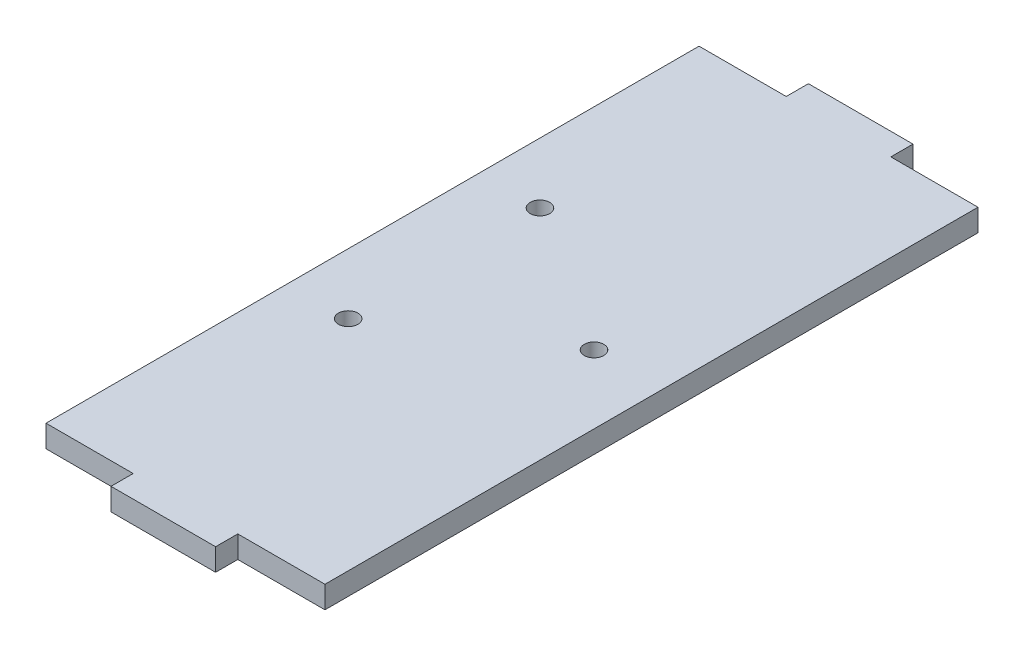
ISO-10303-21;
HEADER;
FILE_DESCRIPTION(('STEP AP214'),'2;1');
FILE_NAME('part.step','',(''),(''),'','','');
FILE_SCHEMA(('AUTOMOTIVE_DESIGN { 1 0 10303 214 1 1 1 1 }'));
ENDSEC;
DATA;
#1=APPLICATION_CONTEXT('core data for automotive mechanical design processes');
#2=APPLICATION_PROTOCOL_DEFINITION('international standard','automotive_design',2000,#1);
#3=PRODUCT_CONTEXT('',#1,'mechanical');
#4=PRODUCT('Part','Part','',(#3));
#5=PRODUCT_RELATED_PRODUCT_CATEGORY('part','',(#4));
#6=PRODUCT_DEFINITION_FORMATION('','',#4);
#7=PRODUCT_DEFINITION_CONTEXT('part definition',#1,'design');
#8=PRODUCT_DEFINITION('design','',#6,#7);
#9=PRODUCT_DEFINITION_SHAPE('','',#8);
#10=(LENGTH_UNIT() NAMED_UNIT(*) SI_UNIT(.MILLI.,.METRE.));
#11=(NAMED_UNIT(*) PLANE_ANGLE_UNIT() SI_UNIT($,.RADIAN.));
#12=(NAMED_UNIT(*) SI_UNIT($,.STERADIAN.) SOLID_ANGLE_UNIT());
#13=UNCERTAINTY_MEASURE_WITH_UNIT(LENGTH_MEASURE(1.E-05),#10,'distance_accuracy_value','');
#14=(GEOMETRIC_REPRESENTATION_CONTEXT(3) GLOBAL_UNCERTAINTY_ASSIGNED_CONTEXT((#13)) GLOBAL_UNIT_ASSIGNED_CONTEXT((#10,
#11,#12)) REPRESENTATION_CONTEXT('',''));
#15=CARTESIAN_POINT('',(0.,0.,0.));
#16=DIRECTION('',(0.,0.,1.));
#17=DIRECTION('',(1.,0.,0.));
#18=AXIS2_PLACEMENT_3D('',#15,#16,#17);
#19=CARTESIAN_POINT('',(-20.,3.18,50.));
#20=DIRECTION('',(1.,0.,0.));
#21=DIRECTION('',(0.,0.,-1.));
#22=AXIS2_PLACEMENT_3D('',#19,#20,#21);
#23=PLANE('',#22);
#24=DIRECTION('',(0.,1.,0.));
#25=VECTOR('',#24,1.);
#26=CARTESIAN_POINT('',(-20.,0.,46.82));
#27=LINE('',#26,#25);
#28=CARTESIAN_POINT('',(-20.,0.,46.82));
#29=VERTEX_POINT('',#28);
#30=CARTESIAN_POINT('',(-20.,3.18,46.82));
#31=VERTEX_POINT('',#30);
#32=EDGE_CURVE('E63',#29,#31,#27,.T.);
#33=ORIENTED_EDGE('',*,*,#32,.T.);
#34=DIRECTION('',(0.,0.,1.));
#35=VECTOR('',#34,1.);
#36=CARTESIAN_POINT('',(-20.,3.18,50.));
#37=LINE('',#36,#35);
#38=CARTESIAN_POINT('',(-20.,3.18,-46.82));
#39=VERTEX_POINT('',#38);
#40=EDGE_CURVE('E163',#39,#31,#37,.T.);
#41=ORIENTED_EDGE('',*,*,#40,.F.);
#42=DIRECTION('',(0.,1.,0.));
#43=VECTOR('',#42,1.);
#44=CARTESIAN_POINT('',(-20.,0.,-46.82));
#45=LINE('',#44,#43);
#46=CARTESIAN_POINT('',(-20.,0.,-46.82));
#47=VERTEX_POINT('',#46);
#48=EDGE_CURVE('E169',#47,#39,#45,.T.);
#49=ORIENTED_EDGE('',*,*,#48,.F.);
#50=DIRECTION('',(0.,0.,1.));
#51=VECTOR('',#50,1.);
#52=CARTESIAN_POINT('',(-20.,0.,50.));
#53=LINE('',#52,#51);
#54=EDGE_CURVE('E154',#47,#29,#53,.T.);
#55=ORIENTED_EDGE('',*,*,#54,.T.);
#56=EDGE_LOOP('',(#33,#41,#49,#55));
#57=FACE_BOUND('',#56,.T.);
#58=ADVANCED_FACE('F39',(#57),#23,.F.);
#59=CARTESIAN_POINT('',(20.,3.18,50.));
#60=DIRECTION('',(0.,0.,-1.));
#61=DIRECTION('',(-1.,0.,0.));
#62=AXIS2_PLACEMENT_3D('',#59,#60,#61);
#63=PLANE('',#62);
#64=DIRECTION('',(0.,1.,0.));
#65=VECTOR('',#64,1.);
#66=CARTESIAN_POINT('',(7.5,0.,50.));
#67=LINE('',#66,#65);
#68=CARTESIAN_POINT('',(7.5,0.,50.));
#69=VERTEX_POINT('',#68);
#70=CARTESIAN_POINT('',(7.5,3.18,50.));
#71=VERTEX_POINT('',#70);
#72=EDGE_CURVE('E128',#69,#71,#67,.T.);
#73=ORIENTED_EDGE('',*,*,#72,.T.);
#74=DIRECTION('',(1.,0.,0.));
#75=VECTOR('',#74,1.);
#76=CARTESIAN_POINT('',(20.,3.18,50.));
#77=LINE('',#76,#75);
#78=CARTESIAN_POINT('',(-7.5,3.18,50.));
#79=VERTEX_POINT('',#78);
#80=EDGE_CURVE('E161',#79,#71,#77,.T.);
#81=ORIENTED_EDGE('',*,*,#80,.F.);
#82=DIRECTION('',(0.,1.,0.));
#83=VECTOR('',#82,1.);
#84=CARTESIAN_POINT('',(-7.5,0.,50.));
#85=LINE('',#84,#83);
#86=CARTESIAN_POINT('',(-7.5,0.,50.));
#87=VERTEX_POINT('',#86);
#88=EDGE_CURVE('E152',#87,#79,#85,.T.);
#89=ORIENTED_EDGE('',*,*,#88,.F.);
#90=DIRECTION('',(1.,0.,0.));
#91=VECTOR('',#90,1.);
#92=CARTESIAN_POINT('',(20.,0.,50.));
#93=LINE('',#92,#91);
#94=EDGE_CURVE('E146',#87,#69,#93,.T.);
#95=ORIENTED_EDGE('',*,*,#94,.T.);
#96=EDGE_LOOP('',(#73,#81,#89,#95));
#97=FACE_BOUND('',#96,.T.);
#98=ADVANCED_FACE('F151',(#97),#63,.F.);
#99=CARTESIAN_POINT('',(20.,3.18,50.));
#100=DIRECTION('',(-1.,0.,0.));
#101=DIRECTION('',(0.,0.,1.));
#102=AXIS2_PLACEMENT_3D('',#99,#100,#101);
#103=PLANE('',#102);
#104=DIRECTION('',(0.,1.,0.));
#105=VECTOR('',#104,1.);
#106=CARTESIAN_POINT('',(20.,0.,46.82));
#107=LINE('',#106,#105);
#108=CARTESIAN_POINT('',(20.,0.,46.82));
#109=VERTEX_POINT('',#108);
#110=CARTESIAN_POINT('',(20.,3.18,46.82));
#111=VERTEX_POINT('',#110);
#112=EDGE_CURVE('E139',#109,#111,#107,.T.);
#113=ORIENTED_EDGE('',*,*,#112,.F.);
#114=DIRECTION('',(0.,0.,-1.));
#115=VECTOR('',#114,1.);
#116=CARTESIAN_POINT('',(20.,0.,50.));
#117=LINE('',#116,#115);
#118=CARTESIAN_POINT('',(20.,0.,-46.82));
#119=VERTEX_POINT('',#118);
#120=EDGE_CURVE('E153',#109,#119,#117,.T.);
#121=ORIENTED_EDGE('',*,*,#120,.T.);
#122=DIRECTION('',(0.,1.,0.));
#123=VECTOR('',#122,1.);
#124=CARTESIAN_POINT('',(20.,0.,-46.82));
#125=LINE('',#124,#123);
#126=CARTESIAN_POINT('',(20.,3.18,-46.82));
#127=VERTEX_POINT('',#126);
#128=EDGE_CURVE('E187',#119,#127,#125,.T.);
#129=ORIENTED_EDGE('',*,*,#128,.T.);
#130=DIRECTION('',(0.,0.,-1.));
#131=VECTOR('',#130,1.);
#132=CARTESIAN_POINT('',(20.,3.18,50.));
#133=LINE('',#132,#131);
#134=EDGE_CURVE('E47',#111,#127,#133,.T.);
#135=ORIENTED_EDGE('',*,*,#134,.F.);
#136=EDGE_LOOP('',(#113,#121,#129,#135));
#137=FACE_BOUND('',#136,.T.);
#138=ADVANCED_FACE('F253',(#137),#103,.F.);
#139=CARTESIAN_POINT('',(0.,3.18,0.));
#140=DIRECTION('',(0.,1.,0.));
#141=DIRECTION('',(0.,0.,1.));
#142=AXIS2_PLACEMENT_3D('',#139,#140,#141);
#143=PLANE('',#142);
#144=CARTESIAN_POINT('',(-11.3096104987537,3.18,12.1802020374978));
#145=DIRECTION('',(0.,1.,0.));
#146=DIRECTION('',(0.,0.,1.));
#147=AXIS2_PLACEMENT_3D('',#144,#145,#146);
#148=CIRCLE('',#147,1.4);
#149=CARTESIAN_POINT('',(-11.3096104987537,3.18,13.5802020374978));
#150=VERTEX_POINT('',#149);
#151=EDGE_CURVE('E235',#150,#150,#148,.T.);
#152=ORIENTED_EDGE('',*,*,#151,.F.);
#153=EDGE_LOOP('',(#152));
#154=FACE_BOUND('',#153,.T.);
#155=CARTESIAN_POINT('',(10.1903895012463,3.18,-1.56979796250224));
#156=DIRECTION('',(0.,1.,0.));
#157=DIRECTION('',(0.,0.,1.));
#158=AXIS2_PLACEMENT_3D('',#155,#156,#157);
#159=CIRCLE('',#158,1.4);
#160=CARTESIAN_POINT('',(10.1903895012463,3.18,-0.169797962502239));
#161=VERTEX_POINT('',#160);
#162=EDGE_CURVE('E229',#161,#161,#159,.T.);
#163=ORIENTED_EDGE('',*,*,#162,.F.);
#164=EDGE_LOOP('',(#163));
#165=FACE_BOUND('',#164,.T.);
#166=CARTESIAN_POINT('',(-11.3096104987537,3.18,-15.3197979625022));
#167=DIRECTION('',(0.,1.,0.));
#168=DIRECTION('',(0.,0.,1.));
#169=AXIS2_PLACEMENT_3D('',#166,#167,#168);
#170=CIRCLE('',#169,1.4);
#171=CARTESIAN_POINT('',(-11.3096104987537,3.18,-13.9197979625022));
#172=VERTEX_POINT('',#171);
#173=EDGE_CURVE('E223',#172,#172,#170,.T.);
#174=ORIENTED_EDGE('',*,*,#173,.F.);
#175=EDGE_LOOP('',(#174));
#176=FACE_BOUND('',#175,.T.);
#177=ORIENTED_EDGE('',*,*,#80,.T.);
#178=DIRECTION('',(0.,0.,-1.));
#179=VECTOR('',#178,1.);
#180=CARTESIAN_POINT('',(7.5,3.18,50.));
#181=LINE('',#180,#179);
#182=CARTESIAN_POINT('',(7.5,3.18,46.82));
#183=VERTEX_POINT('',#182);
#184=EDGE_CURVE('E134',#71,#183,#181,.T.);
#185=ORIENTED_EDGE('',*,*,#184,.T.);
#186=DIRECTION('',(1.,0.,0.));
#187=VECTOR('',#186,1.);
#188=CARTESIAN_POINT('',(7.5,3.18,46.82));
#189=LINE('',#188,#187);
#190=EDGE_CURVE('E148',#183,#111,#189,.T.);
#191=ORIENTED_EDGE('',*,*,#190,.T.);
#192=ORIENTED_EDGE('',*,*,#134,.T.);
#193=DIRECTION('',(1.,0.,0.));
#194=VECTOR('',#193,1.);
#195=CARTESIAN_POINT('',(7.5,3.18,-46.82));
#196=LINE('',#195,#194);
#197=CARTESIAN_POINT('',(7.5,3.18,-46.82));
#198=VERTEX_POINT('',#197);
#199=EDGE_CURVE('E192',#198,#127,#196,.T.);
#200=ORIENTED_EDGE('',*,*,#199,.F.);
#201=DIRECTION('',(0.,0.,1.));
#202=VECTOR('',#201,1.);
#203=CARTESIAN_POINT('',(7.5,3.18,-50.));
#204=LINE('',#203,#202);
#205=CARTESIAN_POINT('',(7.5,3.18,-50.));
#206=VERTEX_POINT('',#205);
#207=EDGE_CURVE('E174',#206,#198,#204,.T.);
#208=ORIENTED_EDGE('',*,*,#207,.F.);
#209=DIRECTION('',(-1.,0.,0.));
#210=VECTOR('',#209,1.);
#211=CARTESIAN_POINT('',(20.,3.18,-50.));
#212=LINE('',#211,#210);
#213=CARTESIAN_POINT('',(-7.5,3.18,-50.));
#214=VERTEX_POINT('',#213);
#215=EDGE_CURVE('E11',#206,#214,#212,.T.);
#216=ORIENTED_EDGE('',*,*,#215,.T.);
#217=DIRECTION('',(0.,0.,-1.));
#218=VECTOR('',#217,1.);
#219=CARTESIAN_POINT('',(-7.5,3.18,-50.));
#220=LINE('',#219,#218);
#221=CARTESIAN_POINT('',(-7.5,3.18,-46.82));
#222=VERTEX_POINT('',#221);
#223=EDGE_CURVE('E179',#222,#214,#220,.T.);
#224=ORIENTED_EDGE('',*,*,#223,.F.);
#225=DIRECTION('',(1.,0.,0.));
#226=VECTOR('',#225,1.);
#227=CARTESIAN_POINT('',(-7.5,3.18,-46.82));
#228=LINE('',#227,#226);
#229=EDGE_CURVE('E175',#39,#222,#228,.T.);
#230=ORIENTED_EDGE('',*,*,#229,.F.);
#231=ORIENTED_EDGE('',*,*,#40,.T.);
#232=DIRECTION('',(1.,0.,0.));
#233=VECTOR('',#232,1.);
#234=CARTESIAN_POINT('',(-7.5,3.18,46.82));
#235=LINE('',#234,#233);
#236=CARTESIAN_POINT('',(-7.5,3.18,46.82));
#237=VERTEX_POINT('',#236);
#238=EDGE_CURVE('E207',#31,#237,#235,.T.);
#239=ORIENTED_EDGE('',*,*,#238,.T.);
#240=DIRECTION('',(0.,0.,1.));
#241=VECTOR('',#240,1.);
#242=CARTESIAN_POINT('',(-7.5,3.18,50.));
#243=LINE('',#242,#241);
#244=EDGE_CURVE('E211',#237,#79,#243,.T.);
#245=ORIENTED_EDGE('',*,*,#244,.T.);
#246=EDGE_LOOP('',(#177,#185,#191,#192,#200,#208,#216,#224,#230,#231,#239,#245));
#247=FACE_BOUND('',#246,.T.);
#248=ADVANCED_FACE('F250',(#154,#165,#176,#247),#143,.T.);
#249=CARTESIAN_POINT('',(0.,0.,0.));
#250=DIRECTION('',(0.,1.,0.));
#251=DIRECTION('',(0.,0.,1.));
#252=AXIS2_PLACEMENT_3D('',#249,#250,#251);
#253=PLANE('',#252);
#254=CARTESIAN_POINT('',(-11.3096104987537,0.,12.1802020374978));
#255=DIRECTION('',(0.,1.,0.));
#256=DIRECTION('',(0.,0.,1.));
#257=AXIS2_PLACEMENT_3D('',#254,#255,#256);
#258=CIRCLE('',#257,1.4);
#259=CARTESIAN_POINT('',(-11.3096104987537,0.,13.5802020374978));
#260=VERTEX_POINT('',#259);
#261=EDGE_CURVE('E214',#260,#260,#258,.T.);
#262=ORIENTED_EDGE('',*,*,#261,.T.);
#263=EDGE_LOOP('',(#262));
#264=FACE_BOUND('',#263,.T.);
#265=CARTESIAN_POINT('',(10.1903895012463,0.,-1.56979796250224));
#266=DIRECTION('',(0.,1.,0.));
#267=DIRECTION('',(0.,0.,1.));
#268=AXIS2_PLACEMENT_3D('',#265,#266,#267);
#269=CIRCLE('',#268,1.4);
#270=CARTESIAN_POINT('',(10.1903895012463,0.,-0.169797962502239));
#271=VERTEX_POINT('',#270);
#272=EDGE_CURVE('E232',#271,#271,#269,.T.);
#273=ORIENTED_EDGE('',*,*,#272,.T.);
#274=EDGE_LOOP('',(#273));
#275=FACE_BOUND('',#274,.T.);
#276=CARTESIAN_POINT('',(-11.3096104987537,0.,-15.3197979625022));
#277=DIRECTION('',(0.,1.,0.));
#278=DIRECTION('',(0.,0.,1.));
#279=AXIS2_PLACEMENT_3D('',#276,#277,#278);
#280=CIRCLE('',#279,1.4);
#281=CARTESIAN_POINT('',(-11.3096104987537,0.,-13.9197979625022));
#282=VERTEX_POINT('',#281);
#283=EDGE_CURVE('E226',#282,#282,#280,.T.);
#284=ORIENTED_EDGE('',*,*,#283,.T.);
#285=EDGE_LOOP('',(#284));
#286=FACE_BOUND('',#285,.T.);
#287=DIRECTION('',(0.,0.,-1.));
#288=VECTOR('',#287,1.);
#289=CARTESIAN_POINT('',(7.5,0.,50.));
#290=LINE('',#289,#288);
#291=CARTESIAN_POINT('',(7.5,0.,46.82));
#292=VERTEX_POINT('',#291);
#293=EDGE_CURVE('E131',#69,#292,#290,.T.);
#294=ORIENTED_EDGE('',*,*,#293,.F.);
#295=ORIENTED_EDGE('',*,*,#94,.F.);
#296=DIRECTION('',(0.,0.,1.));
#297=VECTOR('',#296,1.);
#298=CARTESIAN_POINT('',(-7.5,0.,50.));
#299=LINE('',#298,#297);
#300=CARTESIAN_POINT('',(-7.5,0.,46.82));
#301=VERTEX_POINT('',#300);
#302=EDGE_CURVE('E210',#301,#87,#299,.T.);
#303=ORIENTED_EDGE('',*,*,#302,.F.);
#304=DIRECTION('',(1.,0.,0.));
#305=VECTOR('',#304,1.);
#306=CARTESIAN_POINT('',(-7.5,0.,46.82));
#307=LINE('',#306,#305);
#308=EDGE_CURVE('E204',#29,#301,#307,.T.);
#309=ORIENTED_EDGE('',*,*,#308,.F.);
#310=ORIENTED_EDGE('',*,*,#54,.F.);
#311=DIRECTION('',(1.,0.,0.));
#312=VECTOR('',#311,1.);
#313=CARTESIAN_POINT('',(-7.5,0.,-46.82));
#314=LINE('',#313,#312);
#315=CARTESIAN_POINT('',(-7.5,0.,-46.82));
#316=VERTEX_POINT('',#315);
#317=EDGE_CURVE('E170',#47,#316,#314,.T.);
#318=ORIENTED_EDGE('',*,*,#317,.T.);
#319=DIRECTION('',(0.,0.,-1.));
#320=VECTOR('',#319,1.);
#321=CARTESIAN_POINT('',(-7.5,0.,-50.));
#322=LINE('',#321,#320);
#323=CARTESIAN_POINT('',(-7.5,0.,-50.));
#324=VERTEX_POINT('',#323);
#325=EDGE_CURVE('E178',#316,#324,#322,.T.);
#326=ORIENTED_EDGE('',*,*,#325,.T.);
#327=DIRECTION('',(-1.,0.,0.));
#328=VECTOR('',#327,1.);
#329=CARTESIAN_POINT('',(20.,0.,-50.));
#330=LINE('',#329,#328);
#331=CARTESIAN_POINT('',(7.5,0.,-50.));
#332=VERTEX_POINT('',#331);
#333=EDGE_CURVE('E42',#332,#324,#330,.T.);
#334=ORIENTED_EDGE('',*,*,#333,.F.);
#335=DIRECTION('',(0.,0.,1.));
#336=VECTOR('',#335,1.);
#337=CARTESIAN_POINT('',(7.5,0.,-50.));
#338=LINE('',#337,#336);
#339=CARTESIAN_POINT('',(7.5,0.,-46.82));
#340=VERTEX_POINT('',#339);
#341=EDGE_CURVE('E195',#332,#340,#338,.T.);
#342=ORIENTED_EDGE('',*,*,#341,.T.);
#343=DIRECTION('',(1.,0.,0.));
#344=VECTOR('',#343,1.);
#345=CARTESIAN_POINT('',(7.5,0.,-46.82));
#346=LINE('',#345,#344);
#347=EDGE_CURVE('E188',#340,#119,#346,.T.);
#348=ORIENTED_EDGE('',*,*,#347,.T.);
#349=ORIENTED_EDGE('',*,*,#120,.F.);
#350=DIRECTION('',(1.,0.,0.));
#351=VECTOR('',#350,1.);
#352=CARTESIAN_POINT('',(7.5,0.,46.82));
#353=LINE('',#352,#351);
#354=EDGE_CURVE('E140',#292,#109,#353,.T.);
#355=ORIENTED_EDGE('',*,*,#354,.F.);
#356=EDGE_LOOP('',(#294,#295,#303,#309,#310,#318,#326,#334,#342,#348,#349,#355));
#357=FACE_BOUND('',#356,.T.);
#358=ADVANCED_FACE('F144',(#264,#275,#286,#357),#253,.F.);
#359=CARTESIAN_POINT('',(20.,3.18,-50.));
#360=DIRECTION('',(0.,0.,1.));
#361=DIRECTION('',(1.,0.,0.));
#362=AXIS2_PLACEMENT_3D('',#359,#360,#361);
#363=PLANE('',#362);
#364=ORIENTED_EDGE('',*,*,#215,.F.);
#365=DIRECTION('',(0.,1.,0.));
#366=VECTOR('',#365,1.);
#367=CARTESIAN_POINT('',(7.5,0.,-50.));
#368=LINE('',#367,#366);
#369=EDGE_CURVE('E157',#332,#206,#368,.T.);
#370=ORIENTED_EDGE('',*,*,#369,.F.);
#371=ORIENTED_EDGE('',*,*,#333,.T.);
#372=DIRECTION('',(0.,1.,0.));
#373=VECTOR('',#372,1.);
#374=CARTESIAN_POINT('',(-7.5,0.,-50.));
#375=LINE('',#374,#373);
#376=EDGE_CURVE('E166',#324,#214,#375,.T.);
#377=ORIENTED_EDGE('',*,*,#376,.T.);
#378=EDGE_LOOP('',(#364,#370,#371,#377));
#379=FACE_BOUND('',#378,.T.);
#380=ADVANCED_FACE('F278',(#379),#363,.F.);
#381=CARTESIAN_POINT('',(-7.5,0.,-50.));
#382=DIRECTION('',(1.,0.,0.));
#383=DIRECTION('',(0.,0.,-1.));
#384=AXIS2_PLACEMENT_3D('',#381,#382,#383);
#385=PLANE('',#384);
#386=ORIENTED_EDGE('',*,*,#223,.T.);
#387=ORIENTED_EDGE('',*,*,#376,.F.);
#388=ORIENTED_EDGE('',*,*,#325,.F.);
#389=DIRECTION('',(0.,1.,0.));
#390=VECTOR('',#389,1.);
#391=CARTESIAN_POINT('',(-7.5,0.,-46.82));
#392=LINE('',#391,#390);
#393=EDGE_CURVE('E172',#316,#222,#392,.T.);
#394=ORIENTED_EDGE('',*,*,#393,.T.);
#395=EDGE_LOOP('',(#386,#387,#388,#394));
#396=FACE_BOUND('',#395,.T.);
#397=ADVANCED_FACE('F275',(#396),#385,.F.);
#398=CARTESIAN_POINT('',(-7.5,0.,-46.82));
#399=DIRECTION('',(0.,0.,1.));
#400=DIRECTION('',(1.,0.,0.));
#401=AXIS2_PLACEMENT_3D('',#398,#399,#400);
#402=PLANE('',#401);
#403=ORIENTED_EDGE('',*,*,#229,.T.);
#404=ORIENTED_EDGE('',*,*,#393,.F.);
#405=ORIENTED_EDGE('',*,*,#317,.F.);
#406=ORIENTED_EDGE('',*,*,#48,.T.);
#407=EDGE_LOOP('',(#403,#404,#405,#406));
#408=FACE_BOUND('',#407,.T.);
#409=ADVANCED_FACE('F269',(#408),#402,.F.);
#410=CARTESIAN_POINT('',(7.5,0.,-50.));
#411=DIRECTION('',(-1.,0.,0.));
#412=DIRECTION('',(0.,0.,1.));
#413=AXIS2_PLACEMENT_3D('',#410,#411,#412);
#414=PLANE('',#413);
#415=ORIENTED_EDGE('',*,*,#207,.T.);
#416=DIRECTION('',(0.,1.,0.));
#417=VECTOR('',#416,1.);
#418=CARTESIAN_POINT('',(7.5,0.,-46.82));
#419=LINE('',#418,#417);
#420=EDGE_CURVE('E185',#340,#198,#419,.T.);
#421=ORIENTED_EDGE('',*,*,#420,.F.);
#422=ORIENTED_EDGE('',*,*,#341,.F.);
#423=ORIENTED_EDGE('',*,*,#369,.T.);
#424=EDGE_LOOP('',(#415,#421,#422,#423));
#425=FACE_BOUND('',#424,.T.);
#426=ADVANCED_FACE('F283',(#425),#414,.F.);
#427=CARTESIAN_POINT('',(7.5,0.,-46.82));
#428=DIRECTION('',(0.,0.,1.));
#429=DIRECTION('',(1.,0.,0.));
#430=AXIS2_PLACEMENT_3D('',#427,#428,#429);
#431=PLANE('',#430);
#432=ORIENTED_EDGE('',*,*,#199,.T.);
#433=ORIENTED_EDGE('',*,*,#128,.F.);
#434=ORIENTED_EDGE('',*,*,#347,.F.);
#435=ORIENTED_EDGE('',*,*,#420,.T.);
#436=EDGE_LOOP('',(#432,#433,#434,#435));
#437=FACE_BOUND('',#436,.T.);
#438=ADVANCED_FACE('F287',(#437),#431,.F.);
#439=CARTESIAN_POINT('',(-7.5,0.,50.));
#440=DIRECTION('',(-1.,0.,0.));
#441=DIRECTION('',(0.,0.,1.));
#442=AXIS2_PLACEMENT_3D('',#439,#440,#441);
#443=PLANE('',#442);
#444=ORIENTED_EDGE('',*,*,#244,.F.);
#445=DIRECTION('',(0.,1.,0.));
#446=VECTOR('',#445,1.);
#447=CARTESIAN_POINT('',(-7.5,0.,46.82));
#448=LINE('',#447,#446);
#449=EDGE_CURVE('E202',#301,#237,#448,.T.);
#450=ORIENTED_EDGE('',*,*,#449,.F.);
#451=ORIENTED_EDGE('',*,*,#302,.T.);
#452=ORIENTED_EDGE('',*,*,#88,.T.);
#453=EDGE_LOOP('',(#444,#450,#451,#452));
#454=FACE_BOUND('',#453,.T.);
#455=ADVANCED_FACE('F262',(#454),#443,.T.);
#456=CARTESIAN_POINT('',(-7.5,0.,46.82));
#457=DIRECTION('',(0.,0.,1.));
#458=DIRECTION('',(1.,0.,0.));
#459=AXIS2_PLACEMENT_3D('',#456,#457,#458);
#460=PLANE('',#459);
#461=ORIENTED_EDGE('',*,*,#238,.F.);
#462=ORIENTED_EDGE('',*,*,#32,.F.);
#463=ORIENTED_EDGE('',*,*,#308,.T.);
#464=ORIENTED_EDGE('',*,*,#449,.T.);
#465=EDGE_LOOP('',(#461,#462,#463,#464));
#466=FACE_BOUND('',#465,.T.);
#467=ADVANCED_FACE('F301',(#466),#460,.T.);
#468=CARTESIAN_POINT('',(7.5,0.,50.));
#469=DIRECTION('',(1.,0.,0.));
#470=DIRECTION('',(0.,0.,-1.));
#471=AXIS2_PLACEMENT_3D('',#468,#469,#470);
#472=PLANE('',#471);
#473=ORIENTED_EDGE('',*,*,#184,.F.);
#474=ORIENTED_EDGE('',*,*,#72,.F.);
#475=ORIENTED_EDGE('',*,*,#293,.T.);
#476=DIRECTION('',(0.,1.,0.));
#477=VECTOR('',#476,1.);
#478=CARTESIAN_POINT('',(7.5,0.,46.82));
#479=LINE('',#478,#477);
#480=EDGE_CURVE('E55',#292,#183,#479,.T.);
#481=ORIENTED_EDGE('',*,*,#480,.T.);
#482=EDGE_LOOP('',(#473,#474,#475,#481));
#483=FACE_BOUND('',#482,.T.);
#484=ADVANCED_FACE('F130',(#483),#472,.T.);
#485=CARTESIAN_POINT('',(7.5,0.,46.82));
#486=DIRECTION('',(0.,0.,1.));
#487=DIRECTION('',(1.,0.,0.));
#488=AXIS2_PLACEMENT_3D('',#485,#486,#487);
#489=PLANE('',#488);
#490=ORIENTED_EDGE('',*,*,#190,.F.);
#491=ORIENTED_EDGE('',*,*,#480,.F.);
#492=ORIENTED_EDGE('',*,*,#354,.T.);
#493=ORIENTED_EDGE('',*,*,#112,.T.);
#494=EDGE_LOOP('',(#490,#491,#492,#493));
#495=FACE_BOUND('',#494,.T.);
#496=ADVANCED_FACE('F291',(#495),#489,.T.);
#497=CARTESIAN_POINT('',(-11.3096104987537,0.,-15.3197979625022));
#498=DIRECTION('',(0.,1.,0.));
#499=DIRECTION('',(0.,0.,1.));
#500=AXIS2_PLACEMENT_3D('',#497,#498,#499);
#501=CYLINDRICAL_SURFACE('',#500,1.4);
#502=ORIENTED_EDGE('',*,*,#283,.F.);
#503=EDGE_LOOP('',(#502));
#504=FACE_BOUND('',#503,.T.);
#505=ORIENTED_EDGE('',*,*,#173,.T.);
#506=EDGE_LOOP('',(#505));
#507=FACE_BOUND('',#506,.T.);
#508=ADVANCED_FACE('F293',(#504,#507),#501,.F.);
#509=CARTESIAN_POINT('',(10.1903895012463,0.,-1.56979796250224));
#510=DIRECTION('',(0.,1.,0.));
#511=DIRECTION('',(0.,0.,1.));
#512=AXIS2_PLACEMENT_3D('',#509,#510,#511);
#513=CYLINDRICAL_SURFACE('',#512,1.4);
#514=ORIENTED_EDGE('',*,*,#272,.F.);
#515=EDGE_LOOP('',(#514));
#516=FACE_BOUND('',#515,.T.);
#517=ORIENTED_EDGE('',*,*,#162,.T.);
#518=EDGE_LOOP('',(#517));
#519=FACE_BOUND('',#518,.T.);
#520=ADVANCED_FACE('F246',(#516,#519),#513,.F.);
#521=CARTESIAN_POINT('',(-11.3096104987537,0.,12.1802020374978));
#522=DIRECTION('',(0.,1.,0.));
#523=DIRECTION('',(0.,0.,1.));
#524=AXIS2_PLACEMENT_3D('',#521,#522,#523);
#525=CYLINDRICAL_SURFACE('',#524,1.4);
#526=ORIENTED_EDGE('',*,*,#261,.F.);
#527=EDGE_LOOP('',(#526));
#528=FACE_BOUND('',#527,.T.);
#529=ORIENTED_EDGE('',*,*,#151,.T.);
#530=EDGE_LOOP('',(#529));
#531=FACE_BOUND('',#530,.T.);
#532=ADVANCED_FACE('F243',(#528,#531),#525,.F.);
#533=CLOSED_SHELL('',(#58,#98,#138,#248,#358,#380,#397,#409,#426,#438,#455,#467,#484,#496,#508,
#520,#532));
#534=MANIFOLD_SOLID_BREP('B2',#533);
#535=ADVANCED_BREP_SHAPE_REPRESENTATION('',(#18,#534),#14);
#536=SHAPE_DEFINITION_REPRESENTATION(#9,#535);
ENDSEC;
END-ISO-10303-21;
